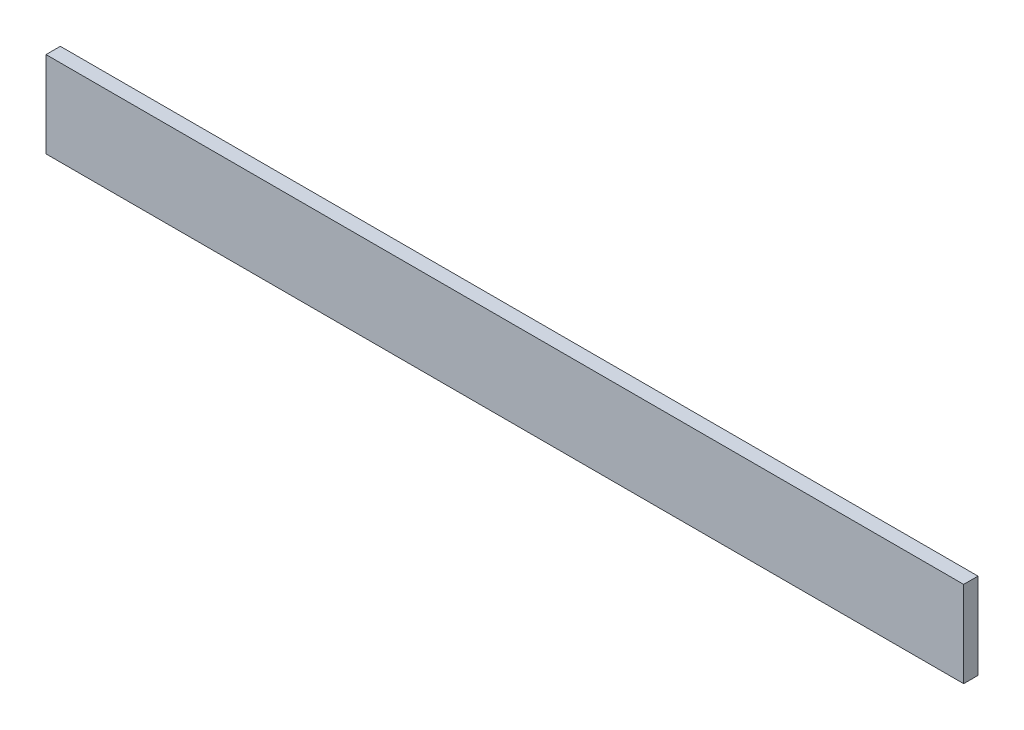
ISO-10303-21;
HEADER;
FILE_DESCRIPTION(('STEP AP214'),'2;1');
FILE_NAME('part.step','',(''),(''),'','','');
FILE_SCHEMA(('AUTOMOTIVE_DESIGN { 1 0 10303 214 1 1 1 1 }'));
ENDSEC;
DATA;
#1=APPLICATION_CONTEXT('core data for automotive mechanical design processes');
#2=APPLICATION_PROTOCOL_DEFINITION('international standard','automotive_design',2000,#1);
#3=PRODUCT_CONTEXT('',#1,'mechanical');
#4=PRODUCT('Part','Part','',(#3));
#5=PRODUCT_RELATED_PRODUCT_CATEGORY('part','',(#4));
#6=PRODUCT_DEFINITION_FORMATION('','',#4);
#7=PRODUCT_DEFINITION_CONTEXT('part definition',#1,'design');
#8=PRODUCT_DEFINITION('design','',#6,#7);
#9=PRODUCT_DEFINITION_SHAPE('','',#8);
#10=(LENGTH_UNIT() NAMED_UNIT(*) SI_UNIT(.MILLI.,.METRE.));
#11=(NAMED_UNIT(*) PLANE_ANGLE_UNIT() SI_UNIT($,.RADIAN.));
#12=(NAMED_UNIT(*) SI_UNIT($,.STERADIAN.) SOLID_ANGLE_UNIT());
#13=UNCERTAINTY_MEASURE_WITH_UNIT(LENGTH_MEASURE(1.E-05),#10,'distance_accuracy_value','');
#14=(GEOMETRIC_REPRESENTATION_CONTEXT(3) GLOBAL_UNCERTAINTY_ASSIGNED_CONTEXT((#13)) GLOBAL_UNIT_ASSIGNED_CONTEXT((#10,
#11,#12)) REPRESENTATION_CONTEXT('',''));
#15=CARTESIAN_POINT('',(0.,0.,0.));
#16=DIRECTION('',(0.,0.,1.));
#17=DIRECTION('',(1.,0.,0.));
#18=AXIS2_PLACEMENT_3D('',#15,#16,#17);
#19=CARTESIAN_POINT('',(-203.2,38.1,6.35));
#20=DIRECTION('',(1.,0.,0.));
#21=DIRECTION('',(0.,0.,-1.));
#22=AXIS2_PLACEMENT_3D('',#19,#20,#21);
#23=PLANE('',#22);
#24=DIRECTION('',(0.,-1.,0.));
#25=VECTOR('',#24,1.);
#26=CARTESIAN_POINT('',(-203.2,38.1,0.));
#27=LINE('',#26,#25);
#28=CARTESIAN_POINT('',(-203.2,38.1,0.));
#29=VERTEX_POINT('',#28);
#30=CARTESIAN_POINT('',(-203.2,0.,0.));
#31=VERTEX_POINT('',#30);
#32=EDGE_CURVE('E96',#29,#31,#27,.T.);
#33=ORIENTED_EDGE('',*,*,#32,.T.);
#34=DIRECTION('',(0.,0.,-1.));
#35=VECTOR('',#34,1.);
#36=CARTESIAN_POINT('',(-203.2,0.,6.35));
#37=LINE('',#36,#35);
#38=CARTESIAN_POINT('',(-203.2,0.,6.35));
#39=VERTEX_POINT('',#38);
#40=EDGE_CURVE('E11',#39,#31,#37,.T.);
#41=ORIENTED_EDGE('',*,*,#40,.F.);
#42=DIRECTION('',(0.,-1.,0.));
#43=VECTOR('',#42,1.);
#44=CARTESIAN_POINT('',(-203.2,38.1,6.35));
#45=LINE('',#44,#43);
#46=CARTESIAN_POINT('',(-203.2,38.1,6.35));
#47=VERTEX_POINT('',#46);
#48=EDGE_CURVE('E84',#47,#39,#45,.T.);
#49=ORIENTED_EDGE('',*,*,#48,.F.);
#50=DIRECTION('',(0.,0.,-1.));
#51=VECTOR('',#50,1.);
#52=CARTESIAN_POINT('',(-203.2,38.1,6.35));
#53=LINE('',#52,#51);
#54=EDGE_CURVE('E92',#47,#29,#53,.T.);
#55=ORIENTED_EDGE('',*,*,#54,.T.);
#56=EDGE_LOOP('',(#33,#41,#49,#55));
#57=FACE_BOUND('',#56,.T.);
#58=ADVANCED_FACE('F33',(#57),#23,.F.);
#59=CARTESIAN_POINT('',(-203.2,0.,6.35));
#60=DIRECTION('',(0.,1.,0.));
#61=DIRECTION('',(0.,0.,1.));
#62=AXIS2_PLACEMENT_3D('',#59,#60,#61);
#63=PLANE('',#62);
#64=DIRECTION('',(1.,0.,0.));
#65=VECTOR('',#64,1.);
#66=CARTESIAN_POINT('',(-203.2,0.,0.));
#67=LINE('',#66,#65);
#68=CARTESIAN_POINT('',(203.2,0.,0.));
#69=VERTEX_POINT('',#68);
#70=EDGE_CURVE('E88',#31,#69,#67,.T.);
#71=ORIENTED_EDGE('',*,*,#70,.T.);
#72=DIRECTION('',(0.,0.,-1.));
#73=VECTOR('',#72,1.);
#74=CARTESIAN_POINT('',(203.2,0.,6.35));
#75=LINE('',#74,#73);
#76=CARTESIAN_POINT('',(203.2,0.,6.35));
#77=VERTEX_POINT('',#76);
#78=EDGE_CURVE('E41',#77,#69,#75,.T.);
#79=ORIENTED_EDGE('',*,*,#78,.F.);
#80=DIRECTION('',(1.,0.,0.));
#81=VECTOR('',#80,1.);
#82=CARTESIAN_POINT('',(-203.2,0.,6.35));
#83=LINE('',#82,#81);
#84=EDGE_CURVE('E79',#39,#77,#83,.T.);
#85=ORIENTED_EDGE('',*,*,#84,.F.);
#86=ORIENTED_EDGE('',*,*,#40,.T.);
#87=EDGE_LOOP('',(#71,#79,#85,#86));
#88=FACE_BOUND('',#87,.T.);
#89=ADVANCED_FACE('F87',(#88),#63,.F.);
#90=CARTESIAN_POINT('',(203.2,38.1,6.35));
#91=DIRECTION('',(-1.,0.,0.));
#92=DIRECTION('',(0.,-1.,0.));
#93=AXIS2_PLACEMENT_3D('',#90,#91,#92);
#94=PLANE('',#93);
#95=DIRECTION('',(0.,1.,0.));
#96=VECTOR('',#95,1.);
#97=CARTESIAN_POINT('',(203.2,38.1,0.));
#98=LINE('',#97,#96);
#99=CARTESIAN_POINT('',(203.2,38.1,0.));
#100=VERTEX_POINT('',#99);
#101=EDGE_CURVE('E66',#69,#100,#98,.T.);
#102=ORIENTED_EDGE('',*,*,#101,.T.);
#103=DIRECTION('',(0.,0.,-1.));
#104=VECTOR('',#103,1.);
#105=CARTESIAN_POINT('',(203.2,38.1,6.35));
#106=LINE('',#105,#104);
#107=CARTESIAN_POINT('',(203.2,38.1,6.35));
#108=VERTEX_POINT('',#107);
#109=EDGE_CURVE('E89',#108,#100,#106,.T.);
#110=ORIENTED_EDGE('',*,*,#109,.F.);
#111=DIRECTION('',(0.,1.,0.));
#112=VECTOR('',#111,1.);
#113=CARTESIAN_POINT('',(203.2,38.1,6.35));
#114=LINE('',#113,#112);
#115=EDGE_CURVE('E82',#77,#108,#114,.T.);
#116=ORIENTED_EDGE('',*,*,#115,.F.);
#117=ORIENTED_EDGE('',*,*,#78,.T.);
#118=EDGE_LOOP('',(#102,#110,#116,#117));
#119=FACE_BOUND('',#118,.T.);
#120=ADVANCED_FACE('F90',(#119),#94,.F.);
#121=CARTESIAN_POINT('',(-203.2,38.1,6.35));
#122=DIRECTION('',(0.,-1.,0.));
#123=DIRECTION('',(1.,0.,0.));
#124=AXIS2_PLACEMENT_3D('',#121,#122,#123);
#125=PLANE('',#124);
#126=DIRECTION('',(-1.,0.,0.));
#127=VECTOR('',#126,1.);
#128=CARTESIAN_POINT('',(-203.2,38.1,0.));
#129=LINE('',#128,#127);
#130=EDGE_CURVE('E72',#100,#29,#129,.T.);
#131=ORIENTED_EDGE('',*,*,#130,.T.);
#132=ORIENTED_EDGE('',*,*,#54,.F.);
#133=DIRECTION('',(-1.,0.,0.));
#134=VECTOR('',#133,1.);
#135=CARTESIAN_POINT('',(-203.2,38.1,6.35));
#136=LINE('',#135,#134);
#137=EDGE_CURVE('E49',#108,#47,#136,.T.);
#138=ORIENTED_EDGE('',*,*,#137,.F.);
#139=ORIENTED_EDGE('',*,*,#109,.T.);
#140=EDGE_LOOP('',(#131,#132,#138,#139));
#141=FACE_BOUND('',#140,.T.);
#142=ADVANCED_FACE('F103',(#141),#125,.F.);
#143=CARTESIAN_POINT('',(0.,0.,6.35));
#144=DIRECTION('',(0.,0.,1.));
#145=DIRECTION('',(1.,0.,0.));
#146=AXIS2_PLACEMENT_3D('',#143,#144,#145);
#147=PLANE('',#146);
#148=ORIENTED_EDGE('',*,*,#48,.T.);
#149=ORIENTED_EDGE('',*,*,#84,.T.);
#150=ORIENTED_EDGE('',*,*,#115,.T.);
#151=ORIENTED_EDGE('',*,*,#137,.T.);
#152=EDGE_LOOP('',(#148,#149,#150,#151));
#153=FACE_BOUND('',#152,.T.);
#154=ADVANCED_FACE('F80',(#153),#147,.T.);
#155=CARTESIAN_POINT('',(0.,0.,0.));
#156=DIRECTION('',(0.,0.,1.));
#157=DIRECTION('',(1.,0.,0.));
#158=AXIS2_PLACEMENT_3D('',#155,#156,#157);
#159=PLANE('',#158);
#160=ORIENTED_EDGE('',*,*,#32,.F.);
#161=ORIENTED_EDGE('',*,*,#130,.F.);
#162=ORIENTED_EDGE('',*,*,#101,.F.);
#163=ORIENTED_EDGE('',*,*,#70,.F.);
#164=EDGE_LOOP('',(#160,#161,#162,#163));
#165=FACE_BOUND('',#164,.T.);
#166=ADVANCED_FACE('F106',(#165),#159,.F.);
#167=CLOSED_SHELL('',(#58,#89,#120,#142,#154,#166));
#168=MANIFOLD_SOLID_BREP('B2',#167);
#169=ADVANCED_BREP_SHAPE_REPRESENTATION('',(#18,#168),#14);
#170=SHAPE_DEFINITION_REPRESENTATION(#9,#169);
ENDSEC;
END-ISO-10303-21;
